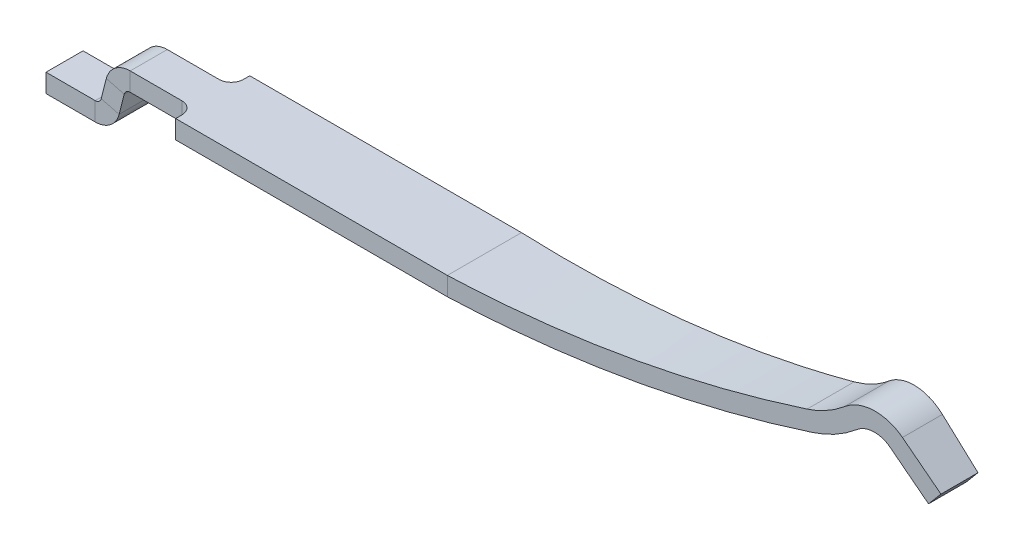
ISO-10303-21;
HEADER;
FILE_DESCRIPTION(('STEP AP214'),'2;1');
FILE_NAME('part.step','',(''),(''),'','','');
FILE_SCHEMA(('AUTOMOTIVE_DESIGN { 1 0 10303 214 1 1 1 1 }'));
ENDSEC;
DATA;
#1=APPLICATION_CONTEXT('core data for automotive mechanical design processes');
#2=APPLICATION_PROTOCOL_DEFINITION('international standard','automotive_design',2000,#1);
#3=PRODUCT_CONTEXT('',#1,'mechanical');
#4=PRODUCT('Part','Part','',(#3));
#5=PRODUCT_RELATED_PRODUCT_CATEGORY('part','',(#4));
#6=PRODUCT_DEFINITION_FORMATION('','',#4);
#7=PRODUCT_DEFINITION_CONTEXT('part definition',#1,'design');
#8=PRODUCT_DEFINITION('design','',#6,#7);
#9=PRODUCT_DEFINITION_SHAPE('','',#8);
#10=(LENGTH_UNIT() NAMED_UNIT(*) SI_UNIT(.MILLI.,.METRE.));
#11=(NAMED_UNIT(*) PLANE_ANGLE_UNIT() SI_UNIT($,.RADIAN.));
#12=(NAMED_UNIT(*) SI_UNIT($,.STERADIAN.) SOLID_ANGLE_UNIT());
#13=UNCERTAINTY_MEASURE_WITH_UNIT(LENGTH_MEASURE(1.E-05),#10,'distance_accuracy_value','');
#14=(GEOMETRIC_REPRESENTATION_CONTEXT(3) GLOBAL_UNCERTAINTY_ASSIGNED_CONTEXT((#13)) GLOBAL_UNIT_ASSIGNED_CONTEXT((#10,
#11,#12)) REPRESENTATION_CONTEXT('',''));
#15=CARTESIAN_POINT('',(0.,0.,0.));
#16=DIRECTION('',(0.,0.,1.));
#17=DIRECTION('',(1.,0.,0.));
#18=AXIS2_PLACEMENT_3D('',#15,#16,#17);
#19=CARTESIAN_POINT('',(0.,0.,0.));
#20=DIRECTION('',(1.,0.,0.));
#21=DIRECTION('',(0.,0.,-1.));
#22=AXIS2_PLACEMENT_3D('',#19,#20,#21);
#23=PLANE('',#22);
#24=DIRECTION('',(0.,0.,-1.));
#25=VECTOR('',#24,1.);
#26=CARTESIAN_POINT('',(0.,0.35,0.3));
#27=LINE('',#26,#25);
#28=CARTESIAN_POINT('',(0.,0.35,-0.25));
#29=VERTEX_POINT('',#28);
#30=CARTESIAN_POINT('',(0.,0.35,-0.3));
#31=VERTEX_POINT('',#30);
#32=EDGE_CURVE('E284',#29,#31,#27,.T.);
#33=ORIENTED_EDGE('',*,*,#32,.F.);
#34=DIRECTION('',(0.,1.,0.));
#35=VECTOR('',#34,1.);
#36=CARTESIAN_POINT('',(0.,0.,-0.25));
#37=LINE('',#36,#35);
#38=CARTESIAN_POINT('',(0.,0.5,-0.25));
#39=VERTEX_POINT('',#38);
#40=EDGE_CURVE('E306',#29,#39,#37,.T.);
#41=ORIENTED_EDGE('',*,*,#40,.T.);
#42=DIRECTION('',(0.,0.,-1.));
#43=VECTOR('',#42,1.);
#44=CARTESIAN_POINT('',(0.,0.5,0.3));
#45=LINE('',#44,#43);
#46=CARTESIAN_POINT('',(0.,0.5,-0.3));
#47=VERTEX_POINT('',#46);
#48=EDGE_CURVE('E292',#39,#47,#45,.T.);
#49=ORIENTED_EDGE('',*,*,#48,.T.);
#50=DIRECTION('',(0.,-1.,0.));
#51=VECTOR('',#50,1.);
#52=CARTESIAN_POINT('',(0.,0.5,-0.3));
#53=LINE('',#52,#51);
#54=EDGE_CURVE('E289',#47,#31,#53,.T.);
#55=ORIENTED_EDGE('',*,*,#54,.T.);
#56=EDGE_LOOP('',(#33,#41,#49,#55));
#57=FACE_BOUND('',#56,.T.);
#58=ADVANCED_FACE('F33',(#57),#23,.F.);
#59=CARTESIAN_POINT('',(1.7,0.5,0.3));
#60=DIRECTION('',(0.,0.,-1.));
#61=DIRECTION('',(0.,1.,0.));
#62=AXIS2_PLACEMENT_3D('',#59,#60,#61);
#63=PLANE('',#62);
#64=DIRECTION('',(0.,-1.,0.));
#65=VECTOR('',#64,1.);
#66=CARTESIAN_POINT('',(0.,0.5,0.3));
#67=LINE('',#66,#65);
#68=CARTESIAN_POINT('',(0.,0.5,0.3));
#69=VERTEX_POINT('',#68);
#70=CARTESIAN_POINT('',(0.,0.35,0.3));
#71=VERTEX_POINT('',#70);
#72=EDGE_CURVE('E281',#69,#71,#67,.T.);
#73=ORIENTED_EDGE('',*,*,#72,.T.);
#74=DIRECTION('',(-1.,0.,0.));
#75=VECTOR('',#74,1.);
#76=CARTESIAN_POINT('',(1.7,0.35,0.3));
#77=LINE('',#76,#75);
#78=CARTESIAN_POINT('',(2.2,0.35,0.3));
#79=VERTEX_POINT('',#78);
#80=EDGE_CURVE('E303',#79,#71,#77,.T.);
#81=ORIENTED_EDGE('',*,*,#80,.F.);
#82=DIRECTION('',(0.,-1.,0.));
#83=VECTOR('',#82,1.);
#84=CARTESIAN_POINT('',(2.2,0.5,0.3));
#85=LINE('',#84,#83);
#86=CARTESIAN_POINT('',(2.2,0.5,0.3));
#87=VERTEX_POINT('',#86);
#88=EDGE_CURVE('E481',#87,#79,#85,.T.);
#89=ORIENTED_EDGE('',*,*,#88,.F.);
#90=DIRECTION('',(-1.,0.,0.));
#91=VECTOR('',#90,1.);
#92=CARTESIAN_POINT('',(1.7,0.5,0.3));
#93=LINE('',#92,#91);
#94=EDGE_CURVE('E295',#87,#69,#93,.T.);
#95=ORIENTED_EDGE('',*,*,#94,.T.);
#96=EDGE_LOOP('',(#73,#81,#89,#95));
#97=FACE_BOUND('',#96,.T.);
#98=ADVANCED_FACE('F535',(#97),#63,.F.);
#99=CARTESIAN_POINT('',(1.7,0.35,0.3));
#100=DIRECTION('',(0.,1.,0.));
#101=DIRECTION('',(0.,0.,1.));
#102=AXIS2_PLACEMENT_3D('',#99,#100,#101);
#103=PLANE('',#102);
#104=CARTESIAN_POINT('',(0.,0.35,0.25));
#105=VERTEX_POINT('',#104);
#106=EDGE_CURVE('E286',#71,#105,#27,.T.);
#107=ORIENTED_EDGE('',*,*,#106,.T.);
#108=CARTESIAN_POINT('',(-0.1,0.35,0.25));
#109=DIRECTION('',(0.,1.,0.));
#110=DIRECTION('',(0.,0.,1.));
#111=AXIS2_PLACEMENT_3D('',#108,#109,#110);
#112=CIRCLE('',#111,0.1);
#113=CARTESIAN_POINT('',(-0.1,0.35,0.15));
#114=VERTEX_POINT('',#113);
#115=EDGE_CURVE('E381',#105,#114,#112,.T.);
#116=ORIENTED_EDGE('',*,*,#115,.T.);
#117=DIRECTION('',(1.,0.,0.));
#118=VECTOR('',#117,1.);
#119=CARTESIAN_POINT('',(-0.517954851978347,0.35,0.15));
#120=LINE('',#119,#118);
#121=CARTESIAN_POINT('',(-0.517954851978347,0.35,0.15));
#122=VERTEX_POINT('',#121);
#123=EDGE_CURVE('E312',#122,#114,#120,.T.);
#124=ORIENTED_EDGE('',*,*,#123,.F.);
#125=DIRECTION('',(0.,0.,1.));
#126=VECTOR('',#125,1.);
#127=CARTESIAN_POINT('',(-0.517954851978347,0.35,0.3));
#128=LINE('',#127,#126);
#129=CARTESIAN_POINT('',(-0.517954851978347,0.35,-0.15));
#130=VERTEX_POINT('',#129);
#131=EDGE_CURVE('E328',#122,#130,#128,.F.);
#132=ORIENTED_EDGE('',*,*,#131,.T.);
#133=DIRECTION('',(1.,0.,0.));
#134=VECTOR('',#133,1.);
#135=CARTESIAN_POINT('',(1.7,0.35,-0.15));
#136=LINE('',#135,#134);
#137=CARTESIAN_POINT('',(-0.1,0.35,-0.15));
#138=VERTEX_POINT('',#137);
#139=EDGE_CURVE('E315',#130,#138,#136,.T.);
#140=ORIENTED_EDGE('',*,*,#139,.T.);
#141=CARTESIAN_POINT('',(-0.1,0.35,-0.25));
#142=DIRECTION('',(0.,1.,0.));
#143=DIRECTION('',(0.,0.,1.));
#144=AXIS2_PLACEMENT_3D('',#141,#142,#143);
#145=CIRCLE('',#144,0.1);
#146=EDGE_CURVE('E379',#138,#29,#145,.T.);
#147=ORIENTED_EDGE('',*,*,#146,.T.);
#148=ORIENTED_EDGE('',*,*,#32,.T.);
#149=DIRECTION('',(-1.,0.,0.));
#150=VECTOR('',#149,1.);
#151=CARTESIAN_POINT('',(1.7,0.35,-0.3));
#152=LINE('',#151,#150);
#153=CARTESIAN_POINT('',(2.2,0.35,-0.3));
#154=VERTEX_POINT('',#153);
#155=EDGE_CURVE('E300',#154,#31,#152,.T.);
#156=ORIENTED_EDGE('',*,*,#155,.F.);
#157=DIRECTION('',(0.,0.,-1.));
#158=VECTOR('',#157,1.);
#159=CARTESIAN_POINT('',(2.2,0.35,0.3));
#160=LINE('',#159,#158);
#161=EDGE_CURVE('E476',#79,#154,#160,.T.);
#162=ORIENTED_EDGE('',*,*,#161,.F.);
#163=ORIENTED_EDGE('',*,*,#80,.T.);
#164=EDGE_LOOP('',(#107,#116,#124,#132,#140,#147,#148,#156,#162,#163));
#165=FACE_BOUND('',#164,.T.);
#166=ADVANCED_FACE('F396',(#165),#103,.F.);
#167=CARTESIAN_POINT('',(1.7,0.5,-0.3));
#168=DIRECTION('',(0.,0.,-1.));
#169=DIRECTION('',(-1.,0.,0.));
#170=AXIS2_PLACEMENT_3D('',#167,#168,#169);
#171=PLANE('',#170);
#172=ORIENTED_EDGE('',*,*,#54,.F.);
#173=DIRECTION('',(-1.,0.,0.));
#174=VECTOR('',#173,1.);
#175=CARTESIAN_POINT('',(1.7,0.5,-0.3));
#176=LINE('',#175,#174);
#177=CARTESIAN_POINT('',(2.2,0.5,-0.3));
#178=VERTEX_POINT('',#177);
#179=EDGE_CURVE('E297',#178,#47,#176,.T.);
#180=ORIENTED_EDGE('',*,*,#179,.F.);
#181=DIRECTION('',(0.,1.,0.));
#182=VECTOR('',#181,1.);
#183=CARTESIAN_POINT('',(2.2,0.5,-0.3));
#184=LINE('',#183,#182);
#185=EDGE_CURVE('E472',#154,#178,#184,.T.);
#186=ORIENTED_EDGE('',*,*,#185,.F.);
#187=ORIENTED_EDGE('',*,*,#155,.T.);
#188=EDGE_LOOP('',(#172,#180,#186,#187));
#189=FACE_BOUND('',#188,.T.);
#190=ADVANCED_FACE('F470',(#189),#171,.T.);
#191=CARTESIAN_POINT('',(1.7,0.5,0.3));
#192=DIRECTION('',(0.,1.,0.));
#193=DIRECTION('',(0.,0.,1.));
#194=AXIS2_PLACEMENT_3D('',#191,#192,#193);
#195=PLANE('',#194);
#196=CARTESIAN_POINT('',(0.,0.5,0.25));
#197=VERTEX_POINT('',#196);
#198=EDGE_CURVE('E294',#69,#197,#45,.T.);
#199=ORIENTED_EDGE('',*,*,#198,.F.);
#200=ORIENTED_EDGE('',*,*,#94,.F.);
#201=DIRECTION('',(0.,0.,1.));
#202=VECTOR('',#201,1.);
#203=CARTESIAN_POINT('',(2.2,0.5,0.3));
#204=LINE('',#203,#202);
#205=EDGE_CURVE('E475',#178,#87,#204,.T.);
#206=ORIENTED_EDGE('',*,*,#205,.F.);
#207=ORIENTED_EDGE('',*,*,#179,.T.);
#208=ORIENTED_EDGE('',*,*,#48,.F.);
#209=CARTESIAN_POINT('',(-0.1,0.5,-0.25));
#210=DIRECTION('',(0.,1.,0.));
#211=DIRECTION('',(0.,0.,1.));
#212=AXIS2_PLACEMENT_3D('',#209,#210,#211);
#213=CIRCLE('',#212,0.1);
#214=CARTESIAN_POINT('',(-0.1,0.5,-0.15));
#215=VERTEX_POINT('',#214);
#216=EDGE_CURVE('E377',#39,#215,#213,.F.);
#217=ORIENTED_EDGE('',*,*,#216,.T.);
#218=DIRECTION('',(-1.,0.,0.));
#219=VECTOR('',#218,1.);
#220=CARTESIAN_POINT('',(-0.517954851978347,0.5,-0.15));
#221=LINE('',#220,#219);
#222=CARTESIAN_POINT('',(-0.517954851978347,0.5,-0.15));
#223=VERTEX_POINT('',#222);
#224=EDGE_CURVE('E285',#223,#215,#221,.F.);
#225=ORIENTED_EDGE('',*,*,#224,.F.);
#226=DIRECTION('',(0.,0.,1.));
#227=VECTOR('',#226,1.);
#228=CARTESIAN_POINT('',(-0.517954851978347,0.5,0.3));
#229=LINE('',#228,#227);
#230=CARTESIAN_POINT('',(-0.517954851978347,0.5,0.15));
#231=VERTEX_POINT('',#230);
#232=EDGE_CURVE('E247',#223,#231,#229,.T.);
#233=ORIENTED_EDGE('',*,*,#232,.T.);
#234=DIRECTION('',(1.,0.,0.));
#235=VECTOR('',#234,1.);
#236=CARTESIAN_POINT('',(1.7,0.5,0.15));
#237=LINE('',#236,#235);
#238=CARTESIAN_POINT('',(-0.1,0.5,0.15));
#239=VERTEX_POINT('',#238);
#240=EDGE_CURVE('E309',#231,#239,#237,.T.);
#241=ORIENTED_EDGE('',*,*,#240,.T.);
#242=CARTESIAN_POINT('',(-0.1,0.5,0.25));
#243=DIRECTION('',(0.,1.,0.));
#244=DIRECTION('',(0.,0.,1.));
#245=AXIS2_PLACEMENT_3D('',#242,#243,#244);
#246=CIRCLE('',#245,0.1);
#247=EDGE_CURVE('E210',#239,#197,#246,.F.);
#248=ORIENTED_EDGE('',*,*,#247,.T.);
#249=EDGE_LOOP('',(#199,#200,#206,#207,#208,#217,#225,#233,#241,#248));
#250=FACE_BOUND('',#249,.T.);
#251=ADVANCED_FACE('F387',(#250),#195,.T.);
#252=ORIENTED_EDGE('',*,*,#198,.T.);
#253=DIRECTION('',(0.,-1.,0.));
#254=VECTOR('',#253,1.);
#255=CARTESIAN_POINT('',(0.,0.,0.25));
#256=LINE('',#255,#254);
#257=EDGE_CURVE('E372',#197,#105,#256,.T.);
#258=ORIENTED_EDGE('',*,*,#257,.T.);
#259=ORIENTED_EDGE('',*,*,#106,.F.);
#260=ORIENTED_EDGE('',*,*,#72,.F.);
#261=EDGE_LOOP('',(#252,#258,#259,#260));
#262=FACE_BOUND('',#261,.T.);
#263=ADVANCED_FACE('F394',(#262),#23,.F.);
#264=CARTESIAN_POINT('',(-0.517954851978347,0.5,0.15));
#265=DIRECTION('',(0.,0.,1.));
#266=DIRECTION('',(0.,-1.,0.));
#267=AXIS2_PLACEMENT_3D('',#264,#265,#266);
#268=PLANE('',#267);
#269=ORIENTED_EDGE('',*,*,#123,.T.);
#270=DIRECTION('',(0.,-1.,0.));
#271=VECTOR('',#270,1.);
#272=CARTESIAN_POINT('',(-0.1,0.5,0.15));
#273=LINE('',#272,#271);
#274=EDGE_CURVE('E375',#114,#239,#273,.F.);
#275=ORIENTED_EDGE('',*,*,#274,.T.);
#276=ORIENTED_EDGE('',*,*,#240,.F.);
#277=DIRECTION('',(0.,-1.,0.));
#278=VECTOR('',#277,1.);
#279=CARTESIAN_POINT('',(-0.517954851978347,0.5,0.15));
#280=LINE('',#279,#278);
#281=EDGE_CURVE('E325',#231,#122,#280,.T.);
#282=ORIENTED_EDGE('',*,*,#281,.T.);
#283=EDGE_LOOP('',(#269,#275,#276,#282));
#284=FACE_BOUND('',#283,.T.);
#285=ADVANCED_FACE('F398',(#284),#268,.T.);
#286=CARTESIAN_POINT('',(-0.517954851978347,0.5,-0.15));
#287=DIRECTION('',(0.,0.,-1.));
#288=DIRECTION('',(-1.,0.,0.));
#289=AXIS2_PLACEMENT_3D('',#286,#287,#288);
#290=PLANE('',#289);
#291=ORIENTED_EDGE('',*,*,#224,.T.);
#292=DIRECTION('',(0.,1.,0.));
#293=VECTOR('',#292,1.);
#294=CARTESIAN_POINT('',(-0.1,0.5,-0.15));
#295=LINE('',#294,#293);
#296=EDGE_CURVE('E370',#215,#138,#295,.F.);
#297=ORIENTED_EDGE('',*,*,#296,.T.);
#298=ORIENTED_EDGE('',*,*,#139,.F.);
#299=DIRECTION('',(0.,1.,0.));
#300=VECTOR('',#299,1.);
#301=CARTESIAN_POINT('',(-0.517954851978347,0.5,-0.15));
#302=LINE('',#301,#300);
#303=EDGE_CURVE('E331',#130,#223,#302,.T.);
#304=ORIENTED_EDGE('',*,*,#303,.T.);
#305=EDGE_LOOP('',(#291,#297,#298,#304));
#306=FACE_BOUND('',#305,.T.);
#307=ADVANCED_FACE('F453',(#306),#290,.T.);
#308=CARTESIAN_POINT('',(-0.517954851978347,0.3,0.));
#309=DIRECTION('',(0.,0.,-1.));
#310=DIRECTION('',(-1.,0.,0.));
#311=AXIS2_PLACEMENT_3D('',#308,#309,#310);
#312=CYLINDRICAL_SURFACE('',#311,0.2);
#313=DIRECTION('',(0.,0.,-1.));
#314=VECTOR('',#313,1.);
#315=CARTESIAN_POINT('',(-0.711686668360144,0.349678801529522,0.));
#316=LINE('',#315,#314);
#317=CARTESIAN_POINT('',(-0.711686668360144,0.349678801529522,-0.15));
#318=VERTEX_POINT('',#317);
#319=CARTESIAN_POINT('',(-0.711686668360144,0.349678801529522,0.15));
#320=VERTEX_POINT('',#319);
#321=EDGE_CURVE('E253',#318,#320,#316,.F.);
#322=ORIENTED_EDGE('',*,*,#321,.T.);
#323=CARTESIAN_POINT('',(-0.517954851978347,0.3,0.15));
#324=DIRECTION('',(0.,0.,-1.));
#325=DIRECTION('',(-1.,0.,0.));
#326=AXIS2_PLACEMENT_3D('',#323,#324,#325);
#327=CIRCLE('',#326,0.2);
#328=EDGE_CURVE('E243',#320,#231,#327,.T.);
#329=ORIENTED_EDGE('',*,*,#328,.T.);
#330=ORIENTED_EDGE('',*,*,#232,.F.);
#331=CARTESIAN_POINT('',(-0.517954851978347,0.3,-0.15));
#332=DIRECTION('',(0.,0.,-1.));
#333=DIRECTION('',(-1.,0.,0.));
#334=AXIS2_PLACEMENT_3D('',#331,#332,#333);
#335=CIRCLE('',#334,0.2);
#336=EDGE_CURVE('E318',#318,#223,#335,.T.);
#337=ORIENTED_EDGE('',*,*,#336,.F.);
#338=EDGE_LOOP('',(#322,#329,#330,#337));
#339=FACE_BOUND('',#338,.T.);
#340=ADVANCED_FACE('F456',(#339),#312,.T.);
#341=CARTESIAN_POINT('',(-0.711686668360144,0.349678801529522,0.15));
#342=DIRECTION('',(0.,0.,1.));
#343=DIRECTION('',(1.,0.,0.));
#344=AXIS2_PLACEMENT_3D('',#341,#342,#343);
#345=PLANE('',#344);
#346=DIRECTION('',(0.968659081908986,-0.248394007647608,0.));
#347=VECTOR('',#346,1.);
#348=CARTESIAN_POINT('',(-0.711686668360144,0.349678801529522,0.15));
#349=LINE('',#348,#347);
#350=CARTESIAN_POINT('',(-0.566387806073796,0.31241970038238,0.15));
#351=VERTEX_POINT('',#350);
#352=EDGE_CURVE('E238',#320,#351,#349,.T.);
#353=ORIENTED_EDGE('',*,*,#352,.T.);
#354=CARTESIAN_POINT('',(-0.517954851978347,0.3,0.15));
#355=DIRECTION('',(0.,0.,-1.));
#356=DIRECTION('',(-1.,0.,0.));
#357=AXIS2_PLACEMENT_3D('',#354,#355,#356);
#358=CIRCLE('',#357,0.0499999999999999);
#359=EDGE_CURVE('E240',#351,#122,#358,.T.);
#360=ORIENTED_EDGE('',*,*,#359,.T.);
#361=ORIENTED_EDGE('',*,*,#281,.F.);
#362=ORIENTED_EDGE('',*,*,#328,.F.);
#363=EDGE_LOOP('',(#353,#360,#361,#362));
#364=FACE_BOUND('',#363,.T.);
#365=ADVANCED_FACE('F405',(#364),#345,.T.);
#366=CARTESIAN_POINT('',(-0.517954851978347,0.3,0.));
#367=DIRECTION('',(0.,0.,-1.));
#368=DIRECTION('',(-1.,0.,0.));
#369=AXIS2_PLACEMENT_3D('',#366,#367,#368);
#370=CYLINDRICAL_SURFACE('',#369,0.0499999999999999);
#371=DIRECTION('',(0.,0.,-1.));
#372=VECTOR('',#371,1.);
#373=CARTESIAN_POINT('',(-0.566387806073796,0.31241970038238,-0.15));
#374=LINE('',#373,#372);
#375=CARTESIAN_POINT('',(-0.566387806073796,0.31241970038238,-0.15));
#376=VERTEX_POINT('',#375);
#377=EDGE_CURVE('E235',#351,#376,#374,.T.);
#378=ORIENTED_EDGE('',*,*,#377,.T.);
#379=CARTESIAN_POINT('',(-0.517954851978347,0.3,-0.15));
#380=DIRECTION('',(0.,0.,-1.));
#381=DIRECTION('',(-1.,0.,0.));
#382=AXIS2_PLACEMENT_3D('',#379,#380,#381);
#383=CIRCLE('',#382,0.0499999999999999);
#384=EDGE_CURVE('E244',#376,#130,#383,.T.);
#385=ORIENTED_EDGE('',*,*,#384,.T.);
#386=ORIENTED_EDGE('',*,*,#131,.F.);
#387=ORIENTED_EDGE('',*,*,#359,.F.);
#388=EDGE_LOOP('',(#378,#385,#386,#387));
#389=FACE_BOUND('',#388,.T.);
#390=ADVANCED_FACE('F403',(#389),#370,.F.);
#391=CARTESIAN_POINT('',(-0.711686668360144,0.349678801529522,-0.15));
#392=DIRECTION('',(0.,0.,-1.));
#393=DIRECTION('',(-1.,0.,0.));
#394=AXIS2_PLACEMENT_3D('',#391,#392,#393);
#395=PLANE('',#394);
#396=DIRECTION('',(-0.968659081908986,0.248394007647608,0.));
#397=VECTOR('',#396,1.);
#398=CARTESIAN_POINT('',(-0.711686668360144,0.349678801529522,-0.15));
#399=LINE('',#398,#397);
#400=EDGE_CURVE('E239',#376,#318,#399,.T.);
#401=ORIENTED_EDGE('',*,*,#400,.T.);
#402=ORIENTED_EDGE('',*,*,#336,.T.);
#403=ORIENTED_EDGE('',*,*,#303,.F.);
#404=ORIENTED_EDGE('',*,*,#384,.F.);
#405=EDGE_LOOP('',(#401,#402,#403,#404));
#406=FACE_BOUND('',#405,.T.);
#407=ADVANCED_FACE('F450',(#406),#395,.T.);
#408=CARTESIAN_POINT('',(-0.753253714264694,0.18758029961762,-0.15));
#409=DIRECTION('',(-0.968659081908986,0.248394007647608,0.));
#410=DIRECTION('',(-0.248394007647608,-0.968659081908986,0.));
#411=AXIS2_PLACEMENT_3D('',#408,#409,#410);
#412=PLANE('',#411);
#413=DIRECTION('',(0.,0.,1.));
#414=VECTOR('',#413,1.);
#415=CARTESIAN_POINT('',(-0.753253714264694,0.18758029961762,-0.15));
#416=LINE('',#415,#414);
#417=CARTESIAN_POINT('',(-0.753253714264694,0.18758029961762,-0.15));
#418=VERTEX_POINT('',#417);
#419=CARTESIAN_POINT('',(-0.753253714264694,0.18758029961762,0.15));
#420=VERTEX_POINT('',#419);
#421=EDGE_CURVE('E346',#418,#420,#416,.T.);
#422=ORIENTED_EDGE('',*,*,#421,.T.);
#423=DIRECTION('',(-0.248394007647608,-0.968659081908986,0.));
#424=VECTOR('',#423,1.);
#425=CARTESIAN_POINT('',(-0.753253714264694,0.18758029961762,0.15));
#426=LINE('',#425,#424);
#427=EDGE_CURVE('E266',#420,#320,#426,.F.);
#428=ORIENTED_EDGE('',*,*,#427,.T.);
#429=ORIENTED_EDGE('',*,*,#321,.F.);
#430=DIRECTION('',(0.248394007647608,0.968659081908986,0.));
#431=VECTOR('',#430,1.);
#432=CARTESIAN_POINT('',(-0.753253714264694,0.18758029961762,-0.15));
#433=LINE('',#432,#431);
#434=EDGE_CURVE('E334',#418,#318,#433,.T.);
#435=ORIENTED_EDGE('',*,*,#434,.F.);
#436=EDGE_LOOP('',(#422,#428,#429,#435));
#437=FACE_BOUND('',#436,.T.);
#438=ADVANCED_FACE('F445',(#437),#412,.T.);
#439=CARTESIAN_POINT('',(-0.753253714264694,0.18758029961762,0.15));
#440=DIRECTION('',(0.,0.,1.));
#441=DIRECTION('',(1.,0.,0.));
#442=AXIS2_PLACEMENT_3D('',#439,#440,#441);
#443=PLANE('',#442);
#444=DIRECTION('',(0.968659081908986,-0.248394007647608,0.));
#445=VECTOR('',#444,1.);
#446=CARTESIAN_POINT('',(-0.753253714264694,0.18758029961762,0.15));
#447=LINE('',#446,#445);
#448=CARTESIAN_POINT('',(-0.607954851978346,0.150321198470478,0.15));
#449=VERTEX_POINT('',#448);
#450=EDGE_CURVE('E349',#420,#449,#447,.T.);
#451=ORIENTED_EDGE('',*,*,#450,.T.);
#452=DIRECTION('',(0.248394007647608,0.968659081908986,0.));
#453=VECTOR('',#452,1.);
#454=CARTESIAN_POINT('',(-0.607954851978346,0.150321198470478,0.15));
#455=LINE('',#454,#453);
#456=EDGE_CURVE('E263',#449,#351,#455,.T.);
#457=ORIENTED_EDGE('',*,*,#456,.T.);
#458=ORIENTED_EDGE('',*,*,#352,.F.);
#459=ORIENTED_EDGE('',*,*,#427,.F.);
#460=EDGE_LOOP('',(#451,#457,#458,#459));
#461=FACE_BOUND('',#460,.T.);
#462=ADVANCED_FACE('F412',(#461),#443,.T.);
#463=CARTESIAN_POINT('',(-0.607954851978346,0.150321198470478,-0.15));
#464=DIRECTION('',(0.968659081908986,-0.248394007647608,0.));
#465=DIRECTION('',(0.248394007647608,0.968659081908986,0.));
#466=AXIS2_PLACEMENT_3D('',#463,#464,#465);
#467=PLANE('',#466);
#468=DIRECTION('',(0.,0.,1.));
#469=VECTOR('',#468,1.);
#470=CARTESIAN_POINT('',(-0.607954851978346,0.150321198470478,-0.15));
#471=LINE('',#470,#469);
#472=CARTESIAN_POINT('',(-0.607954851978346,0.150321198470478,-0.15));
#473=VERTEX_POINT('',#472);
#474=EDGE_CURVE('E352',#449,#473,#471,.F.);
#475=ORIENTED_EDGE('',*,*,#474,.T.);
#476=DIRECTION('',(0.248394007647608,0.968659081908986,0.));
#477=VECTOR('',#476,1.);
#478=CARTESIAN_POINT('',(-0.607954851978346,0.150321198470478,-0.15));
#479=LINE('',#478,#477);
#480=EDGE_CURVE('E267',#473,#376,#479,.T.);
#481=ORIENTED_EDGE('',*,*,#480,.T.);
#482=ORIENTED_EDGE('',*,*,#377,.F.);
#483=ORIENTED_EDGE('',*,*,#456,.F.);
#484=EDGE_LOOP('',(#475,#481,#482,#483));
#485=FACE_BOUND('',#484,.T.);
#486=ADVANCED_FACE('F410',(#485),#467,.T.);
#487=CARTESIAN_POINT('',(-0.753253714264694,0.18758029961762,-0.15));
#488=DIRECTION('',(0.,0.,-1.));
#489=DIRECTION('',(-1.,0.,0.));
#490=AXIS2_PLACEMENT_3D('',#487,#488,#489);
#491=PLANE('',#490);
#492=DIRECTION('',(-0.968659081908986,0.248394007647608,0.));
#493=VECTOR('',#492,1.);
#494=CARTESIAN_POINT('',(-0.607954851978346,0.150321198470478,-0.15));
#495=LINE('',#494,#493);
#496=EDGE_CURVE('E280',#473,#418,#495,.T.);
#497=ORIENTED_EDGE('',*,*,#496,.T.);
#498=ORIENTED_EDGE('',*,*,#434,.T.);
#499=ORIENTED_EDGE('',*,*,#400,.F.);
#500=ORIENTED_EDGE('',*,*,#480,.F.);
#501=EDGE_LOOP('',(#497,#498,#499,#500));
#502=FACE_BOUND('',#501,.T.);
#503=ADVANCED_FACE('F448',(#502),#491,.T.);
#504=CARTESIAN_POINT('',(-0.801686668360144,0.2,0.));
#505=DIRECTION('',(0.,0.,1.));
#506=DIRECTION('',(1.,0.,0.));
#507=AXIS2_PLACEMENT_3D('',#504,#505,#506);
#508=CYLINDRICAL_SURFACE('',#507,0.0500000000000001);
#509=DIRECTION('',(0.,0.,1.));
#510=VECTOR('',#509,1.);
#511=CARTESIAN_POINT('',(-0.801686668360144,0.15,-0.15));
#512=LINE('',#511,#510);
#513=CARTESIAN_POINT('',(-0.801686668360144,0.15,-0.15));
#514=VERTEX_POINT('',#513);
#515=CARTESIAN_POINT('',(-0.801686668360144,0.15,0.15));
#516=VERTEX_POINT('',#515);
#517=EDGE_CURVE('E230',#514,#516,#512,.T.);
#518=ORIENTED_EDGE('',*,*,#517,.T.);
#519=CARTESIAN_POINT('',(-0.801686668360144,0.2,0.15));
#520=DIRECTION('',(0.,0.,1.));
#521=DIRECTION('',(1.,0.,0.));
#522=AXIS2_PLACEMENT_3D('',#519,#520,#521);
#523=CIRCLE('',#522,0.0500000000000001);
#524=EDGE_CURVE('E256',#516,#420,#523,.T.);
#525=ORIENTED_EDGE('',*,*,#524,.T.);
#526=ORIENTED_EDGE('',*,*,#421,.F.);
#527=CARTESIAN_POINT('',(-0.801686668360144,0.2,-0.15));
#528=DIRECTION('',(0.,0.,1.));
#529=DIRECTION('',(1.,0.,0.));
#530=AXIS2_PLACEMENT_3D('',#527,#528,#529);
#531=CIRCLE('',#530,0.0500000000000001);
#532=EDGE_CURVE('E250',#514,#418,#531,.T.);
#533=ORIENTED_EDGE('',*,*,#532,.F.);
#534=EDGE_LOOP('',(#518,#525,#526,#533));
#535=FACE_BOUND('',#534,.T.);
#536=ADVANCED_FACE('F442',(#535),#508,.F.);
#537=CARTESIAN_POINT('',(-0.801686668360144,0.15,0.15));
#538=DIRECTION('',(0.,0.,1.));
#539=DIRECTION('',(1.,0.,0.));
#540=AXIS2_PLACEMENT_3D('',#537,#538,#539);
#541=PLANE('',#540);
#542=DIRECTION('',(0.,-1.,0.));
#543=VECTOR('',#542,1.);
#544=CARTESIAN_POINT('',(-0.801686668360144,0.15,0.15));
#545=LINE('',#544,#543);
#546=CARTESIAN_POINT('',(-0.801686668360144,0.,0.15));
#547=VERTEX_POINT('',#546);
#548=EDGE_CURVE('E233',#516,#547,#545,.T.);
#549=ORIENTED_EDGE('',*,*,#548,.T.);
#550=CARTESIAN_POINT('',(-0.801686668360144,0.2,0.15));
#551=DIRECTION('',(0.,0.,1.));
#552=DIRECTION('',(1.,0.,0.));
#553=AXIS2_PLACEMENT_3D('',#550,#551,#552);
#554=CIRCLE('',#553,0.2);
#555=EDGE_CURVE('E259',#547,#449,#554,.T.);
#556=ORIENTED_EDGE('',*,*,#555,.T.);
#557=ORIENTED_EDGE('',*,*,#450,.F.);
#558=ORIENTED_EDGE('',*,*,#524,.F.);
#559=EDGE_LOOP('',(#549,#556,#557,#558));
#560=FACE_BOUND('',#559,.T.);
#561=ADVANCED_FACE('F419',(#560),#541,.T.);
#562=CARTESIAN_POINT('',(-0.801686668360144,0.2,0.));
#563=DIRECTION('',(0.,0.,1.));
#564=DIRECTION('',(1.,0.,0.));
#565=AXIS2_PLACEMENT_3D('',#562,#563,#564);
#566=CYLINDRICAL_SURFACE('',#565,0.2);
#567=DIRECTION('',(0.,0.,1.));
#568=VECTOR('',#567,1.);
#569=CARTESIAN_POINT('',(-0.801686668360144,0.,0.));
#570=LINE('',#569,#568);
#571=CARTESIAN_POINT('',(-0.801686668360144,0.,-0.15));
#572=VERTEX_POINT('',#571);
#573=EDGE_CURVE('E262',#547,#572,#570,.F.);
#574=ORIENTED_EDGE('',*,*,#573,.T.);
#575=CARTESIAN_POINT('',(-0.801686668360144,0.2,-0.15));
#576=DIRECTION('',(0.,0.,1.));
#577=DIRECTION('',(1.,0.,0.));
#578=AXIS2_PLACEMENT_3D('',#575,#576,#577);
#579=CIRCLE('',#578,0.2);
#580=EDGE_CURVE('E343',#572,#473,#579,.T.);
#581=ORIENTED_EDGE('',*,*,#580,.T.);
#582=ORIENTED_EDGE('',*,*,#474,.F.);
#583=ORIENTED_EDGE('',*,*,#555,.F.);
#584=EDGE_LOOP('',(#574,#581,#582,#583));
#585=FACE_BOUND('',#584,.T.);
#586=ADVANCED_FACE('F417',(#585),#566,.T.);
#587=CARTESIAN_POINT('',(-0.801686668360144,0.15,-0.15));
#588=DIRECTION('',(0.,0.,-1.));
#589=DIRECTION('',(-1.,0.,0.));
#590=AXIS2_PLACEMENT_3D('',#587,#588,#589);
#591=PLANE('',#590);
#592=DIRECTION('',(0.,1.,0.));
#593=VECTOR('',#592,1.);
#594=CARTESIAN_POINT('',(-0.801686668360144,0.15,-0.15));
#595=LINE('',#594,#593);
#596=EDGE_CURVE('E234',#572,#514,#595,.T.);
#597=ORIENTED_EDGE('',*,*,#596,.T.);
#598=ORIENTED_EDGE('',*,*,#532,.T.);
#599=ORIENTED_EDGE('',*,*,#496,.F.);
#600=ORIENTED_EDGE('',*,*,#580,.F.);
#601=EDGE_LOOP('',(#597,#598,#599,#600));
#602=FACE_BOUND('',#601,.T.);
#603=ADVANCED_FACE('F437',(#602),#591,.T.);
#604=CARTESIAN_POINT('',(-0.801686668360144,0.15,-0.15));
#605=DIRECTION('',(0.,0.,1.));
#606=DIRECTION('',(1.,0.,0.));
#607=AXIS2_PLACEMENT_3D('',#604,#605,#606);
#608=PLANE('',#607);
#609=DIRECTION('',(0.,1.,0.));
#610=VECTOR('',#609,1.);
#611=CARTESIAN_POINT('',(-1.2,0.15,-0.15));
#612=LINE('',#611,#610);
#613=CARTESIAN_POINT('',(-1.2,0.,-0.15));
#614=VERTEX_POINT('',#613);
#615=CARTESIAN_POINT('',(-1.2,0.15,-0.15));
#616=VERTEX_POINT('',#615);
#617=EDGE_CURVE('E221',#614,#616,#612,.T.);
#618=ORIENTED_EDGE('',*,*,#617,.T.);
#619=DIRECTION('',(-1.,0.,0.));
#620=VECTOR('',#619,1.);
#621=CARTESIAN_POINT('',(-0.801686668360144,0.15,-0.15));
#622=LINE('',#621,#620);
#623=EDGE_CURVE('E276',#514,#616,#622,.T.);
#624=ORIENTED_EDGE('',*,*,#623,.F.);
#625=ORIENTED_EDGE('',*,*,#596,.F.);
#626=DIRECTION('',(1.,0.,0.));
#627=VECTOR('',#626,1.);
#628=CARTESIAN_POINT('',(-0.801686668360144,0.,-0.15));
#629=LINE('',#628,#627);
#630=EDGE_CURVE('E359',#572,#614,#629,.F.);
#631=ORIENTED_EDGE('',*,*,#630,.T.);
#632=EDGE_LOOP('',(#618,#624,#625,#631));
#633=FACE_BOUND('',#632,.T.);
#634=ADVANCED_FACE('F434',(#633),#608,.F.);
#635=CARTESIAN_POINT('',(-0.801686668360144,0.15,-0.15));
#636=DIRECTION('',(0.,-1.,0.));
#637=DIRECTION('',(0.,0.,-1.));
#638=AXIS2_PLACEMENT_3D('',#635,#636,#637);
#639=PLANE('',#638);
#640=DIRECTION('',(0.,0.,-1.));
#641=VECTOR('',#640,1.);
#642=CARTESIAN_POINT('',(-1.2,0.15,-0.15));
#643=LINE('',#642,#641);
#644=CARTESIAN_POINT('',(-1.2,0.15,0.15));
#645=VERTEX_POINT('',#644);
#646=EDGE_CURVE('E225',#616,#645,#643,.F.);
#647=ORIENTED_EDGE('',*,*,#646,.T.);
#648=DIRECTION('',(-1.,0.,0.));
#649=VECTOR('',#648,1.);
#650=CARTESIAN_POINT('',(-0.801686668360144,0.15,0.15));
#651=LINE('',#650,#649);
#652=EDGE_CURVE('E273',#516,#645,#651,.T.);
#653=ORIENTED_EDGE('',*,*,#652,.F.);
#654=ORIENTED_EDGE('',*,*,#517,.F.);
#655=ORIENTED_EDGE('',*,*,#623,.T.);
#656=EDGE_LOOP('',(#647,#653,#654,#655));
#657=FACE_BOUND('',#656,.T.);
#658=ADVANCED_FACE('F440',(#657),#639,.F.);
#659=CARTESIAN_POINT('',(-0.801686668360144,0.15,0.15));
#660=DIRECTION('',(0.,0.,-1.));
#661=DIRECTION('',(0.,1.,0.));
#662=AXIS2_PLACEMENT_3D('',#659,#660,#661);
#663=PLANE('',#662);
#664=DIRECTION('',(0.,1.,0.));
#665=VECTOR('',#664,1.);
#666=CARTESIAN_POINT('',(-1.2,0.15,0.15));
#667=LINE('',#666,#665);
#668=CARTESIAN_POINT('',(-1.2,0.,0.15));
#669=VERTEX_POINT('',#668);
#670=EDGE_CURVE('E365',#645,#669,#667,.F.);
#671=ORIENTED_EDGE('',*,*,#670,.T.);
#672=DIRECTION('',(1.,0.,0.));
#673=VECTOR('',#672,1.);
#674=CARTESIAN_POINT('',(-0.801686668360144,0.,0.15));
#675=LINE('',#674,#673);
#676=EDGE_CURVE('E277',#547,#669,#675,.F.);
#677=ORIENTED_EDGE('',*,*,#676,.F.);
#678=ORIENTED_EDGE('',*,*,#548,.F.);
#679=ORIENTED_EDGE('',*,*,#652,.T.);
#680=EDGE_LOOP('',(#671,#677,#678,#679));
#681=FACE_BOUND('',#680,.T.);
#682=ADVANCED_FACE('F424',(#681),#663,.F.);
#683=CARTESIAN_POINT('',(-0.801686668360144,0.,-0.15));
#684=DIRECTION('',(0.,1.,0.));
#685=DIRECTION('',(0.,0.,1.));
#686=AXIS2_PLACEMENT_3D('',#683,#684,#685);
#687=PLANE('',#686);
#688=DIRECTION('',(0.,0.,1.));
#689=VECTOR('',#688,1.);
#690=CARTESIAN_POINT('',(-1.2,0.,-0.15));
#691=LINE('',#690,#689);
#692=EDGE_CURVE('E270',#669,#614,#691,.F.);
#693=ORIENTED_EDGE('',*,*,#692,.T.);
#694=ORIENTED_EDGE('',*,*,#630,.F.);
#695=ORIENTED_EDGE('',*,*,#573,.F.);
#696=ORIENTED_EDGE('',*,*,#676,.T.);
#697=EDGE_LOOP('',(#693,#694,#695,#696));
#698=FACE_BOUND('',#697,.T.);
#699=ADVANCED_FACE('F429',(#698),#687,.F.);
#700=CARTESIAN_POINT('',(-1.2,0.,0.));
#701=DIRECTION('',(-1.,0.,0.));
#702=DIRECTION('',(0.,0.,1.));
#703=AXIS2_PLACEMENT_3D('',#700,#701,#702);
#704=PLANE('',#703);
#705=ORIENTED_EDGE('',*,*,#617,.F.);
#706=ORIENTED_EDGE('',*,*,#692,.F.);
#707=ORIENTED_EDGE('',*,*,#670,.F.);
#708=ORIENTED_EDGE('',*,*,#646,.F.);
#709=EDGE_LOOP('',(#705,#706,#707,#708));
#710=FACE_BOUND('',#709,.T.);
#711=ADVANCED_FACE('F583',(#710),#704,.T.);
#712=CARTESIAN_POINT('',(-0.1,0.,-0.25));
#713=DIRECTION('',(0.,1.,0.));
#714=DIRECTION('',(0.,0.,1.));
#715=AXIS2_PLACEMENT_3D('',#712,#713,#714);
#716=CYLINDRICAL_SURFACE('',#715,0.1);
#717=ORIENTED_EDGE('',*,*,#146,.F.);
#718=ORIENTED_EDGE('',*,*,#296,.F.);
#719=ORIENTED_EDGE('',*,*,#216,.F.);
#720=ORIENTED_EDGE('',*,*,#40,.F.);
#721=EDGE_LOOP('',(#717,#718,#719,#720));
#722=FACE_BOUND('',#721,.T.);
#723=ADVANCED_FACE('F461',(#722),#716,.F.);
#724=CARTESIAN_POINT('',(-0.1,0.,0.25));
#725=DIRECTION('',(0.,-1.,0.));
#726=DIRECTION('',(0.,0.,-1.));
#727=AXIS2_PLACEMENT_3D('',#724,#725,#726);
#728=CYLINDRICAL_SURFACE('',#727,0.1);
#729=ORIENTED_EDGE('',*,*,#247,.F.);
#730=ORIENTED_EDGE('',*,*,#274,.F.);
#731=ORIENTED_EDGE('',*,*,#115,.F.);
#732=ORIENTED_EDGE('',*,*,#257,.F.);
#733=EDGE_LOOP('',(#729,#730,#731,#732));
#734=FACE_BOUND('',#733,.T.);
#735=ADVANCED_FACE('F35',(#734),#728,.F.);
#736=CARTESIAN_POINT('',(5.65,0.95291183461909,0.3));
#737=DIRECTION('',(-0.6445535438081,-0.764559173095464,0.));
#738=DIRECTION('',(0.764559173095464,-0.6445535438081,0.));
#739=AXIS2_PLACEMENT_3D('',#736,#737,#738);
#740=PLANE('',#739);
#741=DIRECTION('',(0.764219607542158,-0.644267276651234,-0.0298004645016205));
#742=VECTOR('',#741,1.);
#743=CARTESIAN_POINT('',(5.64693616648843,0.955494767133683,0.165587983015571));
#744=LINE('',#743,#742);
#745=CARTESIAN_POINT('',(5.65,0.95291183461909,0.165468509946705));
#746=VERTEX_POINT('',#745);
#747=CARTESIAN_POINT('',(5.95,0.699999999999997,0.153770119507289));
#748=VERTEX_POINT('',#747);
#749=EDGE_CURVE('E55',#746,#748,#744,.T.);
#750=ORIENTED_EDGE('',*,*,#749,.F.);
#751=DIRECTION('',(0.,0.,-1.));
#752=VECTOR('',#751,1.);
#753=CARTESIAN_POINT('',(5.65,0.95291183461909,0.3));
#754=LINE('',#753,#752);
#755=CARTESIAN_POINT('',(5.65,0.95291183461909,-0.165468509946705));
#756=VERTEX_POINT('',#755);
#757=EDGE_CURVE('E217',#746,#756,#754,.T.);
#758=ORIENTED_EDGE('',*,*,#757,.T.);
#759=DIRECTION('',(-0.764219607542158,0.644267276651234,-0.0298004645016205));
#760=VECTOR('',#759,1.);
#761=CARTESIAN_POINT('',(5.66060062606003,0.943975088669243,-0.165055142404864));
#762=LINE('',#761,#760);
#763=CARTESIAN_POINT('',(5.95,0.699999999999997,-0.153770119507289));
#764=VERTEX_POINT('',#763);
#765=EDGE_CURVE('E204',#764,#756,#762,.T.);
#766=ORIENTED_EDGE('',*,*,#765,.F.);
#767=DIRECTION('',(0.,0.,-1.));
#768=VECTOR('',#767,1.);
#769=CARTESIAN_POINT('',(5.95,0.699999999999997,0.3));
#770=LINE('',#769,#768);
#771=EDGE_CURVE('E215',#748,#764,#770,.T.);
#772=ORIENTED_EDGE('',*,*,#771,.F.);
#773=EDGE_LOOP('',(#750,#758,#766,#772));
#774=FACE_BOUND('',#773,.T.);
#775=ADVANCED_FACE('F214',(#774),#740,.T.);
#776=CARTESIAN_POINT('',(5.74668303157121,1.06759571058341,0.3));
#777=DIRECTION('',(0.6445535438081,0.764559173095464,0.));
#778=DIRECTION('',(-0.764559173095464,0.6445535438081,0.));
#779=AXIS2_PLACEMENT_3D('',#776,#777,#778);
#780=PLANE('',#779);
#781=DIRECTION('',(-0.764219607542158,0.644267276651234,0.0298004645016205));
#782=VECTOR('',#781,1.);
#783=CARTESIAN_POINT('',(5.74353333698367,1.07025102737216,0.161821211629584));
#784=LINE('',#783,#782);
#785=CARTESIAN_POINT('',(6.04668303157121,0.814683875964317,0.15));
#786=VERTEX_POINT('',#785);
#787=CARTESIAN_POINT('',(5.74668303157121,1.06759571058341,0.161698390439417));
#788=VERTEX_POINT('',#787);
#789=EDGE_CURVE('E502',#786,#788,#784,.T.);
#790=ORIENTED_EDGE('',*,*,#789,.F.);
#791=DIRECTION('',(0.,0.,1.));
#792=VECTOR('',#791,1.);
#793=CARTESIAN_POINT('',(6.04668303157121,0.814683875964317,0.3));
#794=LINE('',#793,#792);
#795=CARTESIAN_POINT('',(6.04668303157121,0.814683875964317,-0.15));
#796=VERTEX_POINT('',#795);
#797=EDGE_CURVE('E222',#796,#786,#794,.T.);
#798=ORIENTED_EDGE('',*,*,#797,.F.);
#799=DIRECTION('',(0.764219607542158,-0.644267276651234,0.0298004645016205));
#800=VECTOR('',#799,1.);
#801=CARTESIAN_POINT('',(5.75719779655527,1.05873134890772,-0.161288371018876));
#802=LINE('',#801,#800);
#803=CARTESIAN_POINT('',(5.74668303157121,1.06759571058341,-0.161698390439417));
#804=VERTEX_POINT('',#803);
#805=EDGE_CURVE('E48',#804,#796,#802,.T.);
#806=ORIENTED_EDGE('',*,*,#805,.F.);
#807=DIRECTION('',(0.,0.,1.));
#808=VECTOR('',#807,1.);
#809=CARTESIAN_POINT('',(5.74668303157121,1.06759571058341,0.3));
#810=LINE('',#809,#808);
#811=EDGE_CURVE('E496',#804,#788,#810,.T.);
#812=ORIENTED_EDGE('',*,*,#811,.T.);
#813=EDGE_LOOP('',(#790,#798,#806,#812));
#814=FACE_BOUND('',#813,.T.);
#815=ADVANCED_FACE('F501',(#814),#780,.T.);
#816=CARTESIAN_POINT('',(5.52108929123838,0.8,0.));
#817=DIRECTION('',(0.,0.,-1.));
#818=DIRECTION('',(-1.,0.,0.));
#819=AXIS2_PLACEMENT_3D('',#816,#817,#818);
#820=CYLINDRICAL_SURFACE('',#819,0.199999999999996);
#821=CARTESIAN_POINT('',(5.52108929123838,0.8,0.170495335956423));
#822=DIRECTION('',(-0.0389650213051027,0.,-0.999240575194329));
#823=DIRECTION('',(0.999240575194329,0.,-0.0389650213051027));
#824=AXIS2_PLACEMENT_3D('',#821,#822,#823);
#825=ELLIPSE('',#824,0.200152000394,0.199999999999996);
#826=CARTESIAN_POINT('',(5.39217858247676,0.95291183461909,0.175522161966141));
#827=VERTEX_POINT('',#826);
#828=EDGE_CURVE('E511',#827,#746,#825,.T.);
#829=ORIENTED_EDGE('',*,*,#828,.F.);
#830=DIRECTION('',(0.,0.,-1.));
#831=VECTOR('',#830,1.);
#832=CARTESIAN_POINT('',(5.39217858247676,0.95291183461909,0.3));
#833=LINE('',#832,#831);
#834=CARTESIAN_POINT('',(5.39217858247676,0.95291183461909,-0.175522161966141));
#835=VERTEX_POINT('',#834);
#836=EDGE_CURVE('E493',#827,#835,#833,.T.);
#837=ORIENTED_EDGE('',*,*,#836,.T.);
#838=CARTESIAN_POINT('',(5.52108929123838,0.8,-0.170495335956423));
#839=DIRECTION('',(-0.0389650213051028,0.,0.999240575194329));
#840=DIRECTION('',(-0.999240575194329,0.,-0.0389650213051028));
#841=AXIS2_PLACEMENT_3D('',#838,#839,#840);
#842=ELLIPSE('',#841,0.200152000394,0.199999999999996);
#843=EDGE_CURVE('E218',#756,#835,#842,.T.);
#844=ORIENTED_EDGE('',*,*,#843,.F.);
#845=ORIENTED_EDGE('',*,*,#757,.F.);
#846=EDGE_LOOP('',(#829,#837,#844,#845));
#847=FACE_BOUND('',#846,.T.);
#848=ADVANCED_FACE('F797',(#847),#820,.F.);
#849=CARTESIAN_POINT('',(5.52108929123838,0.8,0.));
#850=DIRECTION('',(0.,0.,-1.));
#851=DIRECTION('',(-1.,0.,0.));
#852=AXIS2_PLACEMENT_3D('',#849,#850,#851);
#853=CYLINDRICAL_SURFACE('',#852,0.349999999999997);
#854=DIRECTION('',(0.,0.,1.));
#855=VECTOR('',#854,1.);
#856=CARTESIAN_POINT('',(5.29549555090555,1.06759571058341,0.3));
#857=LINE('',#856,#855);
#858=CARTESIAN_POINT('',(5.29549555090555,1.06759571058341,-0.17929228147343));
#859=VERTEX_POINT('',#858);
#860=CARTESIAN_POINT('',(5.29549555090555,1.06759571058341,0.17929228147343));
#861=VERTEX_POINT('',#860);
#862=EDGE_CURVE('E490',#859,#861,#857,.T.);
#863=ORIENTED_EDGE('',*,*,#862,.T.);
#864=CARTESIAN_POINT('',(5.52108929123838,0.8,0.170495335956423));
#865=DIRECTION('',(-0.0389650213051027,0.,-0.999240575194329));
#866=DIRECTION('',(0.999240575194329,0.,-0.0389650213051027));
#867=AXIS2_PLACEMENT_3D('',#864,#865,#866);
#868=ELLIPSE('',#867,0.350266000689504,0.349999999999997);
#869=EDGE_CURVE('E509',#788,#861,#868,.F.);
#870=ORIENTED_EDGE('',*,*,#869,.F.);
#871=ORIENTED_EDGE('',*,*,#811,.F.);
#872=CARTESIAN_POINT('',(5.52108929123838,0.8,-0.170495335956423));
#873=DIRECTION('',(-0.0389650213051028,0.,0.999240575194329));
#874=DIRECTION('',(-0.999240575194329,0.,-0.0389650213051028));
#875=AXIS2_PLACEMENT_3D('',#872,#873,#874);
#876=ELLIPSE('',#875,0.350266000689504,0.349999999999997);
#877=EDGE_CURVE('E507',#859,#804,#876,.F.);
#878=ORIENTED_EDGE('',*,*,#877,.F.);
#879=EDGE_LOOP('',(#863,#870,#871,#878));
#880=FACE_BOUND('',#879,.T.);
#881=ADVANCED_FACE('F506',(#880),#853,.T.);
#882=CARTESIAN_POINT('',(4.77018809974276,1.69070706314698,0.));
#883=DIRECTION('',(0.,0.,1.));
#884=DIRECTION('',(1.,0.,0.));
#885=AXIS2_PLACEMENT_3D('',#882,#883,#884);
#886=CYLINDRICAL_SURFACE('',#885,0.96499427969817);
#887=CARTESIAN_POINT('',(4.77018809974276,1.69070706314698,0.19977645368822));
#888=DIRECTION('',(-0.0389650213051027,0.,-0.999240575194329));
#889=DIRECTION('',(-0.999240575194329,0.,0.0389650213051027));
#890=AXIS2_PLACEMENT_3D('',#887,#888,#889);
#891=ELLIPSE('',#890,0.965727677251798,0.96499427969817);
#892=CARTESIAN_POINT('',(5.04641321867504,0.766091660116593,0.189005156053407));
#893=VERTEX_POINT('',#892);
#894=EDGE_CURVE('E519',#893,#827,#891,.F.);
#895=ORIENTED_EDGE('',*,*,#894,.F.);
#896=DIRECTION('',(0.,0.,-1.));
#897=VECTOR('',#896,1.);
#898=CARTESIAN_POINT('',(5.04641321867504,0.766091660116593,0.3));
#899=LINE('',#898,#897);
#900=CARTESIAN_POINT('',(5.04641321867504,0.766091660116593,-0.189005156053407));
#901=VERTEX_POINT('',#900);
#902=EDGE_CURVE('E487',#893,#901,#899,.T.);
#903=ORIENTED_EDGE('',*,*,#902,.T.);
#904=CARTESIAN_POINT('',(4.77018809974276,1.69070706314698,-0.19977645368822));
#905=DIRECTION('',(-0.0389650213051028,0.,0.999240575194329));
#906=DIRECTION('',(0.999240575194329,0.,0.0389650213051028));
#907=AXIS2_PLACEMENT_3D('',#904,#905,#906);
#908=ELLIPSE('',#907,0.965727677251798,0.96499427969817);
#909=EDGE_CURVE('E547',#835,#901,#908,.F.);
#910=ORIENTED_EDGE('',*,*,#909,.F.);
#911=ORIENTED_EDGE('',*,*,#836,.F.);
#912=EDGE_LOOP('',(#895,#903,#910,#911));
#913=FACE_BOUND('',#912,.T.);
#914=ADVANCED_FACE('F554',(#913),#886,.T.);
#915=CARTESIAN_POINT('',(4.77018809974276,1.69070706314698,0.));
#916=DIRECTION('',(0.,0.,1.));
#917=DIRECTION('',(1.,0.,0.));
#918=AXIS2_PLACEMENT_3D('',#915,#916,#917);
#919=CYLINDRICAL_SURFACE('',#918,0.81499427969817);
#920=CARTESIAN_POINT('',(4.77018809974276,1.69070706314698,0.19977645368822));
#921=DIRECTION('',(-0.0389650213051027,0.,-0.999240575194329));
#922=DIRECTION('',(-0.999240575194329,0.,0.0389650213051027));
#923=AXIS2_PLACEMENT_3D('',#920,#921,#922);
#924=ELLIPSE('',#923,0.815613676956295,0.81499427969817);
#925=CARTESIAN_POINT('',(5.0034764171711,0.909815113584046,0.19067946094745));
#926=VERTEX_POINT('',#925);
#927=EDGE_CURVE('E513',#861,#926,#924,.T.);
#928=ORIENTED_EDGE('',*,*,#927,.F.);
#929=ORIENTED_EDGE('',*,*,#862,.F.);
#930=CARTESIAN_POINT('',(4.77018809974276,1.69070706314698,-0.19977645368822));
#931=DIRECTION('',(-0.0389650213051028,0.,0.999240575194329));
#932=DIRECTION('',(0.999240575194329,0.,0.0389650213051028));
#933=AXIS2_PLACEMENT_3D('',#930,#931,#932);
#934=ELLIPSE('',#933,0.815613676956295,0.81499427969817);
#935=CARTESIAN_POINT('',(5.0034764171711,0.909815113584046,-0.19067946094745));
#936=VERTEX_POINT('',#935);
#937=EDGE_CURVE('E541',#936,#859,#934,.T.);
#938=ORIENTED_EDGE('',*,*,#937,.F.);
#939=DIRECTION('',(0.,0.,1.));
#940=VECTOR('',#939,1.);
#941=CARTESIAN_POINT('',(5.0034764171711,0.909815113584046,0.3));
#942=LINE('',#941,#940);
#943=EDGE_CURVE('E479',#936,#926,#942,.T.);
#944=ORIENTED_EDGE('',*,*,#943,.T.);
#945=EDGE_LOOP('',(#928,#929,#938,#944));
#946=FACE_BOUND('',#945,.T.);
#947=ADVANCED_FACE('F552',(#946),#919,.F.);
#948=CARTESIAN_POINT('',(2.2,10.293963403097,0.));
#949=DIRECTION('',(0.,0.,1.));
#950=DIRECTION('',(1.,0.,0.));
#951=AXIS2_PLACEMENT_3D('',#948,#949,#950);
#952=CYLINDRICAL_SURFACE('',#951,9.94396340309702);
#953=CARTESIAN_POINT('',(2.2,10.293963403097,0.3));
#954=DIRECTION('',(-0.0389650213051027,0.,-0.999240575194329));
#955=DIRECTION('',(-0.999240575194329,0.,0.0389650213051027));
#956=AXIS2_PLACEMENT_3D('',#953,#954,#955);
#957=ELLIPSE('',#956,9.95152083487318,9.94396340309702);
#958=EDGE_CURVE('E523',#79,#893,#957,.F.);
#959=ORIENTED_EDGE('',*,*,#958,.F.);
#960=ORIENTED_EDGE('',*,*,#161,.T.);
#961=CARTESIAN_POINT('',(2.2,10.293963403097,-0.3));
#962=DIRECTION('',(-0.0389650213051028,0.,0.999240575194329));
#963=DIRECTION('',(0.999240575194329,0.,0.0389650213051028));
#964=AXIS2_PLACEMENT_3D('',#961,#962,#963);
#965=ELLIPSE('',#964,9.95152083487318,9.94396340309702);
#966=EDGE_CURVE('E543',#901,#154,#965,.F.);
#967=ORIENTED_EDGE('',*,*,#966,.F.);
#968=ORIENTED_EDGE('',*,*,#902,.F.);
#969=EDGE_LOOP('',(#959,#960,#967,#968));
#970=FACE_BOUND('',#969,.T.);
#971=ADVANCED_FACE('F533',(#970),#952,.T.);
#972=CARTESIAN_POINT('',(2.2,10.293963403097,0.));
#973=DIRECTION('',(0.,0.,1.));
#974=DIRECTION('',(1.,0.,0.));
#975=AXIS2_PLACEMENT_3D('',#972,#973,#974);
#976=CYLINDRICAL_SURFACE('',#975,9.79396340309702);
#977=CARTESIAN_POINT('',(2.2,10.293963403097,0.3));
#978=DIRECTION('',(-0.0389650213051027,0.,-0.999240575194329));
#979=DIRECTION('',(-0.999240575194329,0.,0.0389650213051027));
#980=AXIS2_PLACEMENT_3D('',#977,#978,#979);
#981=ELLIPSE('',#980,9.80140683457767,9.79396340309702);
#982=EDGE_CURVE('E521',#926,#87,#981,.T.);
#983=ORIENTED_EDGE('',*,*,#982,.F.);
#984=ORIENTED_EDGE('',*,*,#943,.F.);
#985=CARTESIAN_POINT('',(2.2,10.293963403097,-0.3));
#986=DIRECTION('',(-0.0389650213051028,0.,0.999240575194329));
#987=DIRECTION('',(0.999240575194329,0.,0.0389650213051028));
#988=AXIS2_PLACEMENT_3D('',#985,#986,#987);
#989=ELLIPSE('',#988,9.80140683457767,9.79396340309702);
#990=EDGE_CURVE('E539',#178,#936,#989,.T.);
#991=ORIENTED_EDGE('',*,*,#990,.F.);
#992=ORIENTED_EDGE('',*,*,#205,.T.);
#993=EDGE_LOOP('',(#983,#984,#991,#992));
#994=FACE_BOUND('',#993,.T.);
#995=ADVANCED_FACE('F537',(#994),#976,.F.);
#996=CARTESIAN_POINT('',(5.72440625966716,0.432404289416586,0.));
#997=DIRECTION('',(0.764559173095461,-0.644553543808104,0.));
#998=DIRECTION('',(0.,0.,-1.));
#999=AXIS2_PLACEMENT_3D('',#996,#997,#998);
#1000=PLANE('',#999);
#1001=DIRECTION('',(0.644350050086572,0.764317792076058,-0.0251261948852353));
#1002=VECTOR('',#1001,1.);
#1003=CARTESIAN_POINT('',(5.72703823100584,0.435526292002159,0.162464432263144));
#1004=LINE('',#1003,#1002);
#1005=EDGE_CURVE('E12',#748,#786,#1004,.T.);
#1006=ORIENTED_EDGE('',*,*,#1005,.F.);
#1007=ORIENTED_EDGE('',*,*,#771,.T.);
#1008=DIRECTION('',(-0.644350050086572,-0.764317792076058,-0.0251261948852353));
#1009=VECTOR('',#1008,1.);
#1010=CARTESIAN_POINT('',(5.72703823100584,0.435526292002159,-0.162464432263144));
#1011=LINE('',#1010,#1009);
#1012=EDGE_CURVE('E41',#796,#764,#1011,.T.);
#1013=ORIENTED_EDGE('',*,*,#1012,.F.);
#1014=ORIENTED_EDGE('',*,*,#797,.T.);
#1015=EDGE_LOOP('',(#1006,#1007,#1013,#1014));
#1016=FACE_BOUND('',#1015,.T.);
#1017=ADVANCED_FACE('F220',(#1016),#1000,.T.);
#1018=CARTESIAN_POINT('',(-1.2,1.15,-0.432581758313392));
#1019=DIRECTION('',(-0.0389650213051028,0.,0.999240575194329));
#1020=DIRECTION('',(0.999240575194329,0.,0.0389650213051028));
#1021=AXIS2_PLACEMENT_3D('',#1018,#1019,#1020);
#1022=PLANE('',#1021);
#1023=ORIENTED_EDGE('',*,*,#990,.T.);
#1024=ORIENTED_EDGE('',*,*,#937,.T.);
#1025=ORIENTED_EDGE('',*,*,#877,.T.);
#1026=ORIENTED_EDGE('',*,*,#805,.T.);
#1027=ORIENTED_EDGE('',*,*,#1012,.T.);
#1028=ORIENTED_EDGE('',*,*,#765,.T.);
#1029=ORIENTED_EDGE('',*,*,#843,.T.);
#1030=ORIENTED_EDGE('',*,*,#909,.T.);
#1031=ORIENTED_EDGE('',*,*,#966,.T.);
#1032=ORIENTED_EDGE('',*,*,#185,.T.);
#1033=EDGE_LOOP('',(#1023,#1024,#1025,#1026,#1027,#1028,#1029,#1030,#1031,#1032));
#1034=FACE_BOUND('',#1033,.T.);
#1035=ADVANCED_FACE('F203',(#1034),#1022,.F.);
#1036=CARTESIAN_POINT('',(6.04668303157121,1.15,0.15));
#1037=DIRECTION('',(-0.0389650213051027,0.,-0.999240575194329));
#1038=DIRECTION('',(-0.999240575194329,0.,0.0389650213051027));
#1039=AXIS2_PLACEMENT_3D('',#1036,#1037,#1038);
#1040=PLANE('',#1039);
#1041=ORIENTED_EDGE('',*,*,#958,.T.);
#1042=ORIENTED_EDGE('',*,*,#894,.T.);
#1043=ORIENTED_EDGE('',*,*,#828,.T.);
#1044=ORIENTED_EDGE('',*,*,#749,.T.);
#1045=ORIENTED_EDGE('',*,*,#1005,.T.);
#1046=ORIENTED_EDGE('',*,*,#789,.T.);
#1047=ORIENTED_EDGE('',*,*,#869,.T.);
#1048=ORIENTED_EDGE('',*,*,#927,.T.);
#1049=ORIENTED_EDGE('',*,*,#982,.T.);
#1050=ORIENTED_EDGE('',*,*,#88,.T.);
#1051=EDGE_LOOP('',(#1041,#1042,#1043,#1044,#1045,#1046,#1047,#1048,#1049,#1050));
#1052=FACE_BOUND('',#1051,.T.);
#1053=ADVANCED_FACE('F526',(#1052),#1040,.F.);
#1054=CLOSED_SHELL('',(#58,#98,#166,#190,#251,#263,#285,#307,#340,#365,#390,#407,#438,#462,#486,
#503,#536,#561,#586,#603,#634,#658,#682,#699,#711,#723,#735,#775,#815,#848,#881,#914,#947,#971,
#995,#1017,#1035,#1053));
#1055=MANIFOLD_SOLID_BREP('B2',#1054);
#1056=ADVANCED_BREP_SHAPE_REPRESENTATION('',(#18,#1055),#14);
#1057=SHAPE_DEFINITION_REPRESENTATION(#9,#1056);
ENDSEC;
END-ISO-10303-21;
